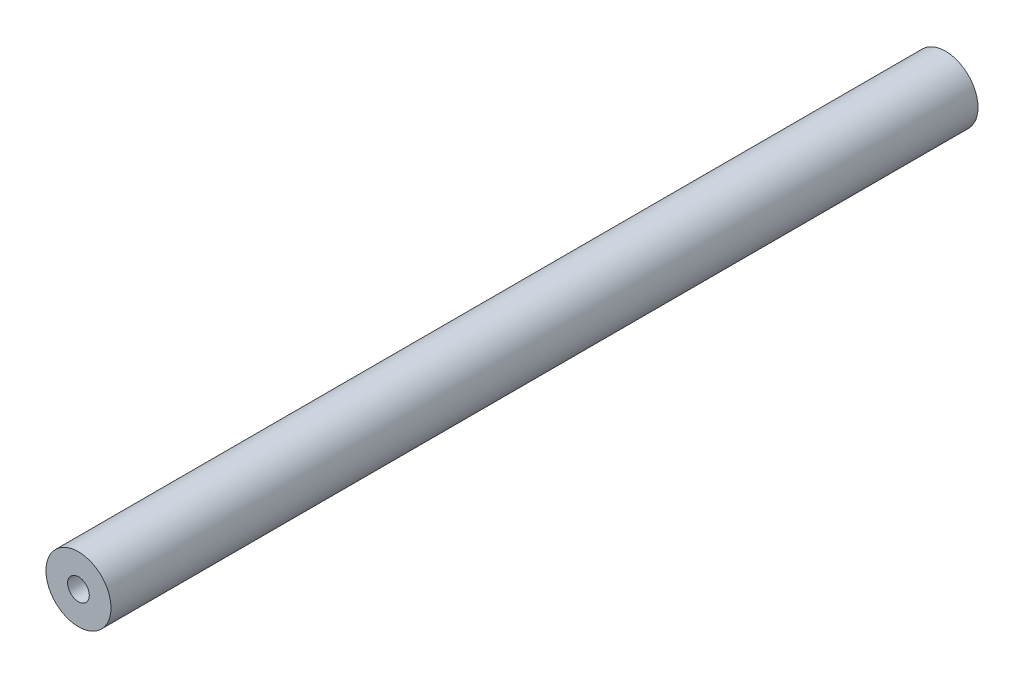
ISO-10303-21;
HEADER;
FILE_DESCRIPTION(('STEP AP214'),'2;1');
FILE_NAME('part.step','',(''),(''),'','','');
FILE_SCHEMA(('AUTOMOTIVE_DESIGN { 1 0 10303 214 1 1 1 1 }'));
ENDSEC;
DATA;
#1=APPLICATION_CONTEXT('core data for automotive mechanical design processes');
#2=APPLICATION_PROTOCOL_DEFINITION('international standard','automotive_design',2000,#1);
#3=PRODUCT_CONTEXT('',#1,'mechanical');
#4=PRODUCT('Part','Part','',(#3));
#5=PRODUCT_RELATED_PRODUCT_CATEGORY('part','',(#4));
#6=PRODUCT_DEFINITION_FORMATION('','',#4);
#7=PRODUCT_DEFINITION_CONTEXT('part definition',#1,'design');
#8=PRODUCT_DEFINITION('design','',#6,#7);
#9=PRODUCT_DEFINITION_SHAPE('','',#8);
#10=(LENGTH_UNIT() NAMED_UNIT(*) SI_UNIT(.MILLI.,.METRE.));
#11=(NAMED_UNIT(*) PLANE_ANGLE_UNIT() SI_UNIT($,.RADIAN.));
#12=(NAMED_UNIT(*) SI_UNIT($,.STERADIAN.) SOLID_ANGLE_UNIT());
#13=UNCERTAINTY_MEASURE_WITH_UNIT(LENGTH_MEASURE(1.E-05),#10,'distance_accuracy_value','');
#14=(GEOMETRIC_REPRESENTATION_CONTEXT(3) GLOBAL_UNCERTAINTY_ASSIGNED_CONTEXT((#13)) GLOBAL_UNIT_ASSIGNED_CONTEXT((#10,
#11,#12)) REPRESENTATION_CONTEXT('',''));
#15=CARTESIAN_POINT('',(0.,0.,0.));
#16=DIRECTION('',(0.,0.,1.));
#17=DIRECTION('',(1.,0.,0.));
#18=AXIS2_PLACEMENT_3D('',#15,#16,#17);
#19=CARTESIAN_POINT('',(0.,0.,1000.));
#20=DIRECTION('',(0.,0.,1.));
#21=DIRECTION('',(1.,0.,0.));
#22=AXIS2_PLACEMENT_3D('',#19,#20,#21);
#23=PLANE('',#22);
#24=CARTESIAN_POINT('',(0.,0.,1000.));
#25=DIRECTION('',(0.,0.,1.));
#26=DIRECTION('',(1.,0.,0.));
#27=AXIS2_PLACEMENT_3D('',#24,#25,#26);
#28=CIRCLE('',#27,37.5);
#29=CARTESIAN_POINT('',(37.5,0.,1000.));
#30=VERTEX_POINT('',#29);
#31=EDGE_CURVE('E11',#30,#30,#28,.T.);
#32=ORIENTED_EDGE('',*,*,#31,.T.);
#33=EDGE_LOOP('',(#32));
#34=FACE_BOUND('',#33,.T.);
#35=CARTESIAN_POINT('',(0.,0.,1000.));
#36=DIRECTION('',(0.,0.,1.));
#37=DIRECTION('',(1.,0.,0.));
#38=AXIS2_PLACEMENT_3D('',#35,#36,#37);
#39=CIRCLE('',#38,12.5);
#40=CARTESIAN_POINT('',(12.5,0.,1000.));
#41=VERTEX_POINT('',#40);
#42=EDGE_CURVE('E56',#41,#41,#39,.T.);
#43=ORIENTED_EDGE('',*,*,#42,.F.);
#44=EDGE_LOOP('',(#43));
#45=FACE_BOUND('',#44,.T.);
#46=ADVANCED_FACE('F42',(#34,#45),#23,.T.);
#47=CARTESIAN_POINT('',(0.,0.,0.));
#48=DIRECTION('',(0.,0.,1.));
#49=DIRECTION('',(1.,0.,0.));
#50=AXIS2_PLACEMENT_3D('',#47,#48,#49);
#51=PLANE('',#50);
#52=CARTESIAN_POINT('',(0.,0.,0.));
#53=DIRECTION('',(0.,0.,1.));
#54=DIRECTION('',(1.,0.,0.));
#55=AXIS2_PLACEMENT_3D('',#52,#53,#54);
#56=CIRCLE('',#55,37.5);
#57=CARTESIAN_POINT('',(37.5,0.,0.));
#58=VERTEX_POINT('',#57);
#59=EDGE_CURVE('E46',#58,#58,#56,.T.);
#60=ORIENTED_EDGE('',*,*,#59,.F.);
#61=EDGE_LOOP('',(#60));
#62=FACE_BOUND('',#61,.T.);
#63=CARTESIAN_POINT('',(0.,0.,0.));
#64=DIRECTION('',(0.,0.,1.));
#65=DIRECTION('',(1.,0.,0.));
#66=AXIS2_PLACEMENT_3D('',#63,#64,#65);
#67=CIRCLE('',#66,12.5);
#68=CARTESIAN_POINT('',(12.5,0.,0.));
#69=VERTEX_POINT('',#68);
#70=EDGE_CURVE('E58',#69,#69,#67,.T.);
#71=ORIENTED_EDGE('',*,*,#70,.T.);
#72=EDGE_LOOP('',(#71));
#73=FACE_BOUND('',#72,.T.);
#74=ADVANCED_FACE('F72',(#62,#73),#51,.F.);
#75=CARTESIAN_POINT('',(0.,0.,1000.));
#76=DIRECTION('',(0.,0.,-1.));
#77=DIRECTION('',(-1.,0.,0.));
#78=AXIS2_PLACEMENT_3D('',#75,#76,#77);
#79=CYLINDRICAL_SURFACE('',#78,37.5);
#80=ORIENTED_EDGE('',*,*,#31,.F.);
#81=EDGE_LOOP('',(#80));
#82=FACE_BOUND('',#81,.T.);
#83=ORIENTED_EDGE('',*,*,#59,.T.);
#84=EDGE_LOOP('',(#83));
#85=FACE_BOUND('',#84,.T.);
#86=ADVANCED_FACE('F44',(#82,#85),#79,.T.);
#87=CARTESIAN_POINT('',(0.,0.,1000.));
#88=DIRECTION('',(0.,0.,-1.));
#89=DIRECTION('',(-1.,0.,0.));
#90=AXIS2_PLACEMENT_3D('',#87,#88,#89);
#91=CYLINDRICAL_SURFACE('',#90,12.5);
#92=ORIENTED_EDGE('',*,*,#42,.T.);
#93=EDGE_LOOP('',(#92));
#94=FACE_BOUND('',#93,.T.);
#95=ORIENTED_EDGE('',*,*,#70,.F.);
#96=EDGE_LOOP('',(#95));
#97=FACE_BOUND('',#96,.T.);
#98=ADVANCED_FACE('F74',(#94,#97),#91,.F.);
#99=CLOSED_SHELL('',(#46,#74,#86,#98));
#100=MANIFOLD_SOLID_BREP('B2',#99);
#101=ADVANCED_BREP_SHAPE_REPRESENTATION('',(#18,#100),#14);
#102=SHAPE_DEFINITION_REPRESENTATION(#9,#101);
ENDSEC;
END-ISO-10303-21;
